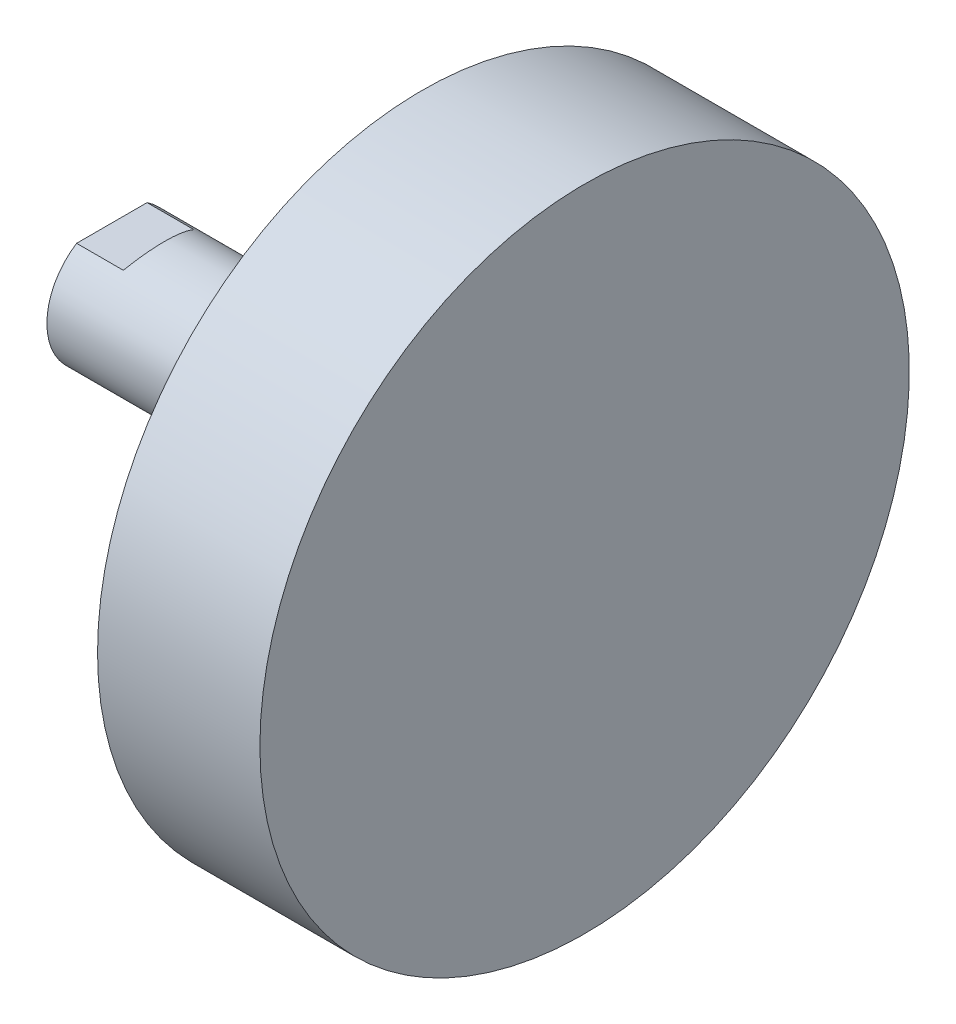
ISO-10303-21;
HEADER;
FILE_DESCRIPTION(('STEP AP214'),'2;1');
FILE_NAME('part.step','',(''),(''),'','','');
FILE_SCHEMA(('AUTOMOTIVE_DESIGN { 1 0 10303 214 1 1 1 1 }'));
ENDSEC;
DATA;
#1=APPLICATION_CONTEXT('core data for automotive mechanical design processes');
#2=APPLICATION_PROTOCOL_DEFINITION('international standard','automotive_design',2000,#1);
#3=PRODUCT_CONTEXT('',#1,'mechanical');
#4=PRODUCT('Part','Part','',(#3));
#5=PRODUCT_RELATED_PRODUCT_CATEGORY('part','',(#4));
#6=PRODUCT_DEFINITION_FORMATION('','',#4);
#7=PRODUCT_DEFINITION_CONTEXT('part definition',#1,'design');
#8=PRODUCT_DEFINITION('design','',#6,#7);
#9=PRODUCT_DEFINITION_SHAPE('','',#8);
#10=(LENGTH_UNIT() NAMED_UNIT(*) SI_UNIT(.MILLI.,.METRE.));
#11=(NAMED_UNIT(*) PLANE_ANGLE_UNIT() SI_UNIT($,.RADIAN.));
#12=(NAMED_UNIT(*) SI_UNIT($,.STERADIAN.) SOLID_ANGLE_UNIT());
#13=UNCERTAINTY_MEASURE_WITH_UNIT(LENGTH_MEASURE(1.E-05),#10,'distance_accuracy_value','');
#14=(GEOMETRIC_REPRESENTATION_CONTEXT(3) GLOBAL_UNCERTAINTY_ASSIGNED_CONTEXT((#13)) GLOBAL_UNIT_ASSIGNED_CONTEXT((#10,
#11,#12)) REPRESENTATION_CONTEXT('',''));
#15=CARTESIAN_POINT('',(0.,0.,0.));
#16=DIRECTION('',(0.,0.,1.));
#17=DIRECTION('',(1.,0.,0.));
#18=AXIS2_PLACEMENT_3D('',#15,#16,#17);
#19=CARTESIAN_POINT('',(80.,0.,0.));
#20=DIRECTION('',(-1.,0.,0.));
#21=DIRECTION('',(0.,0.,1.));
#22=AXIS2_PLACEMENT_3D('',#19,#20,#21);
#23=CYLINDRICAL_SURFACE('',#22,12.5);
#24=CARTESIAN_POINT('',(48.75,0.,0.));
#25=DIRECTION('',(1.,0.,0.));
#26=DIRECTION('',(0.,0.,-1.));
#27=AXIS2_PLACEMENT_3D('',#24,#25,#26);
#28=CIRCLE('',#27,12.5);
#29=CARTESIAN_POINT('',(48.75,0.,-12.5));
#30=VERTEX_POINT('',#29);
#31=EDGE_CURVE('E185',#30,#30,#28,.T.);
#32=ORIENTED_EDGE('',*,*,#31,.F.);
#33=EDGE_LOOP('',(#32));
#34=FACE_BOUND('',#33,.T.);
#35=DIRECTION('',(-1.,0.,0.));
#36=VECTOR('',#35,1.);
#37=CARTESIAN_POINT('',(80.,-10.5,6.78232998312527));
#38=LINE('',#37,#36);
#39=CARTESIAN_POINT('',(-2.,-10.5,6.78232998312527));
#40=VERTEX_POINT('',#39);
#41=CARTESIAN_POINT('',(-11.,-10.5,6.78232998312527));
#42=VERTEX_POINT('',#41);
#43=EDGE_CURVE('E52',#40,#42,#38,.T.);
#44=ORIENTED_EDGE('',*,*,#43,.F.);
#45=CARTESIAN_POINT('',(-8.0621778264911,0.,0.));
#46=DIRECTION('',(-0.866025403784438,-0.500000000000002,0.));
#47=DIRECTION('',(-0.500000000000002,0.866025403784438,0.));
#48=AXIS2_PLACEMENT_3D('',#45,#46,#47);
#49=ELLIPSE('',#48,14.4337567297407,12.5);
#50=CARTESIAN_POINT('',(-2.,-10.5,-6.78232998312527));
#51=VERTEX_POINT('',#50);
#52=EDGE_CURVE('E11',#51,#40,#49,.T.);
#53=ORIENTED_EDGE('',*,*,#52,.F.);
#54=DIRECTION('',(-1.,0.,0.));
#55=VECTOR('',#54,1.);
#56=CARTESIAN_POINT('',(80.,-10.5,-6.78232998312527));
#57=LINE('',#56,#55);
#58=CARTESIAN_POINT('',(-11.,-10.5,-6.78232998312527));
#59=VERTEX_POINT('',#58);
#60=EDGE_CURVE('E172',#59,#51,#57,.F.);
#61=ORIENTED_EDGE('',*,*,#60,.F.);
#62=CARTESIAN_POINT('',(-11.,0.,0.));
#63=DIRECTION('',(-1.,0.,0.));
#64=DIRECTION('',(0.,0.,1.));
#65=AXIS2_PLACEMENT_3D('',#62,#63,#64);
#66=CIRCLE('',#65,12.5);
#67=CARTESIAN_POINT('',(-11.,10.5,-6.78232998312527));
#68=VERTEX_POINT('',#67);
#69=EDGE_CURVE('E184',#68,#59,#66,.T.);
#70=ORIENTED_EDGE('',*,*,#69,.F.);
#71=DIRECTION('',(-1.,0.,0.));
#72=VECTOR('',#71,1.);
#73=CARTESIAN_POINT('',(80.,10.5,-6.78232998312527));
#74=LINE('',#73,#72);
#75=CARTESIAN_POINT('',(-2.,10.5,-6.78232998312525));
#76=VERTEX_POINT('',#75);
#77=EDGE_CURVE('E60',#76,#68,#74,.T.);
#78=ORIENTED_EDGE('',*,*,#77,.F.);
#79=CARTESIAN_POINT('',(-8.06217782649105,0.,0.));
#80=DIRECTION('',(-0.86602540378444,0.499999999999998,0.));
#81=DIRECTION('',(-0.499999999999998,-0.86602540378444,0.));
#82=AXIS2_PLACEMENT_3D('',#79,#80,#81);
#83=ELLIPSE('',#82,14.4337567297406,12.5);
#84=CARTESIAN_POINT('',(-2.,10.5,6.78232998312527));
#85=VERTEX_POINT('',#84);
#86=EDGE_CURVE('E45',#85,#76,#83,.T.);
#87=ORIENTED_EDGE('',*,*,#86,.F.);
#88=DIRECTION('',(-1.,0.,0.));
#89=VECTOR('',#88,1.);
#90=CARTESIAN_POINT('',(80.,10.5,6.78232998312527));
#91=LINE('',#90,#89);
#92=CARTESIAN_POINT('',(-11.,10.5,6.78232998312527));
#93=VERTEX_POINT('',#92);
#94=EDGE_CURVE('E169',#93,#85,#91,.F.);
#95=ORIENTED_EDGE('',*,*,#94,.F.);
#96=EDGE_CURVE('E181',#42,#93,#66,.T.);
#97=ORIENTED_EDGE('',*,*,#96,.F.);
#98=EDGE_LOOP('',(#44,#53,#61,#70,#78,#87,#95,#97));
#99=FACE_BOUND('',#98,.T.);
#100=ADVANCED_FACE('F37',(#34,#99),#23,.T.);
#101=CARTESIAN_POINT('',(-11.,0.,0.));
#102=DIRECTION('',(1.,0.,0.));
#103=DIRECTION('',(0.,0.,-1.));
#104=AXIS2_PLACEMENT_3D('',#101,#102,#103);
#105=PLANE('',#104);
#106=CARTESIAN_POINT('',(-11.,0.,0.));
#107=DIRECTION('',(-1.,0.,0.));
#108=DIRECTION('',(0.,0.,1.));
#109=AXIS2_PLACEMENT_3D('',#106,#107,#108);
#110=CIRCLE('',#109,9.5);
#111=CARTESIAN_POINT('',(-11.,0.,9.5));
#112=VERTEX_POINT('',#111);
#113=EDGE_CURVE('E161',#112,#112,#110,.T.);
#114=ORIENTED_EDGE('',*,*,#113,.F.);
#115=EDGE_LOOP('',(#114));
#116=FACE_BOUND('',#115,.T.);
#117=DIRECTION('',(0.,0.,-1.));
#118=VECTOR('',#117,1.);
#119=CARTESIAN_POINT('',(-11.,-10.5,0.));
#120=LINE('',#119,#118);
#121=EDGE_CURVE('E190',#42,#59,#120,.T.);
#122=ORIENTED_EDGE('',*,*,#121,.F.);
#123=ORIENTED_EDGE('',*,*,#96,.T.);
#124=DIRECTION('',(0.,0.,1.));
#125=VECTOR('',#124,1.);
#126=CARTESIAN_POINT('',(-11.,10.5,0.));
#127=LINE('',#126,#125);
#128=EDGE_CURVE('E188',#68,#93,#127,.T.);
#129=ORIENTED_EDGE('',*,*,#128,.F.);
#130=ORIENTED_EDGE('',*,*,#69,.T.);
#131=EDGE_LOOP('',(#122,#123,#129,#130));
#132=FACE_BOUND('',#131,.T.);
#133=ADVANCED_FACE('F39',(#116,#132),#105,.F.);
#134=CARTESIAN_POINT('',(48.75,0.,0.));
#135=DIRECTION('',(1.,0.,0.));
#136=DIRECTION('',(0.,0.,-1.));
#137=AXIS2_PLACEMENT_3D('',#134,#135,#136);
#138=PLANE('',#137);
#139=ORIENTED_EDGE('',*,*,#31,.T.);
#140=EDGE_LOOP('',(#139));
#141=FACE_BOUND('',#140,.T.);
#142=CARTESIAN_POINT('',(48.75,0.,0.));
#143=DIRECTION('',(-1.,0.,0.));
#144=DIRECTION('',(0.,0.,1.));
#145=AXIS2_PLACEMENT_3D('',#142,#143,#144);
#146=CIRCLE('',#145,62.5);
#147=CARTESIAN_POINT('',(48.75,0.,62.5));
#148=VERTEX_POINT('',#147);
#149=EDGE_CURVE('E178',#148,#148,#146,.T.);
#150=ORIENTED_EDGE('',*,*,#149,.T.);
#151=EDGE_LOOP('',(#150));
#152=FACE_BOUND('',#151,.T.);
#153=ADVANCED_FACE('F97',(#141,#152),#138,.F.);
#154=CARTESIAN_POINT('',(80.,0.,0.));
#155=DIRECTION('',(-1.,0.,0.));
#156=DIRECTION('',(0.,0.,1.));
#157=AXIS2_PLACEMENT_3D('',#154,#155,#156);
#158=CYLINDRICAL_SURFACE('',#157,62.5);
#159=ORIENTED_EDGE('',*,*,#149,.F.);
#160=EDGE_LOOP('',(#159));
#161=FACE_BOUND('',#160,.T.);
#162=CARTESIAN_POINT('',(80.,0.,0.));
#163=DIRECTION('',(-1.,0.,0.));
#164=DIRECTION('',(0.,0.,1.));
#165=AXIS2_PLACEMENT_3D('',#162,#163,#164);
#166=CIRCLE('',#165,62.5);
#167=CARTESIAN_POINT('',(80.,0.,62.5));
#168=VERTEX_POINT('',#167);
#169=EDGE_CURVE('E175',#168,#168,#166,.T.);
#170=ORIENTED_EDGE('',*,*,#169,.T.);
#171=EDGE_LOOP('',(#170));
#172=FACE_BOUND('',#171,.T.);
#173=ADVANCED_FACE('F106',(#161,#172),#158,.T.);
#174=CARTESIAN_POINT('',(80.,12.5,0.));
#175=DIRECTION('',(-1.,0.,0.));
#176=DIRECTION('',(0.,0.,1.));
#177=AXIS2_PLACEMENT_3D('',#174,#175,#176);
#178=PLANE('',#177);
#179=ORIENTED_EDGE('',*,*,#169,.F.);
#180=EDGE_LOOP('',(#179));
#181=FACE_BOUND('',#180,.T.);
#182=ADVANCED_FACE('F102',(#181),#178,.F.);
#183=CARTESIAN_POINT('',(-11.,10.5,25.));
#184=DIRECTION('',(0.,1.,0.));
#185=DIRECTION('',(0.,0.,1.));
#186=AXIS2_PLACEMENT_3D('',#183,#184,#185);
#187=PLANE('',#186);
#188=ORIENTED_EDGE('',*,*,#77,.T.);
#189=ORIENTED_EDGE('',*,*,#128,.T.);
#190=ORIENTED_EDGE('',*,*,#94,.T.);
#191=DIRECTION('',(0.,0.,-1.));
#192=VECTOR('',#191,1.);
#193=CARTESIAN_POINT('',(-2.,10.5,25.));
#194=LINE('',#193,#192);
#195=EDGE_CURVE('E164',#85,#76,#194,.T.);
#196=ORIENTED_EDGE('',*,*,#195,.T.);
#197=EDGE_LOOP('',(#188,#189,#190,#196));
#198=FACE_BOUND('',#197,.T.);
#199=ADVANCED_FACE('F105',(#198),#187,.T.);
#200=CARTESIAN_POINT('',(-2.,10.5,25.));
#201=DIRECTION('',(-0.86602540378444,0.499999999999998,0.));
#202=DIRECTION('',(-0.499999999999998,-0.86602540378444,0.));
#203=AXIS2_PLACEMENT_3D('',#200,#201,#202);
#204=PLANE('',#203);
#205=ORIENTED_EDGE('',*,*,#86,.T.);
#206=ORIENTED_EDGE('',*,*,#195,.F.);
#207=EDGE_LOOP('',(#205,#206));
#208=FACE_BOUND('',#207,.T.);
#209=ADVANCED_FACE('F118',(#208),#204,.T.);
#210=CARTESIAN_POINT('',(8.1036297108185,-28.,25.));
#211=DIRECTION('',(-0.866025403784438,-0.500000000000002,0.));
#212=DIRECTION('',(0.500000000000002,-0.866025403784438,0.));
#213=AXIS2_PLACEMENT_3D('',#210,#211,#212);
#214=PLANE('',#213);
#215=ORIENTED_EDGE('',*,*,#52,.T.);
#216=DIRECTION('',(0.,0.,-1.));
#217=VECTOR('',#216,1.);
#218=CARTESIAN_POINT('',(-2.,-10.5,25.));
#219=LINE('',#218,#217);
#220=EDGE_CURVE('E166',#40,#51,#219,.T.);
#221=ORIENTED_EDGE('',*,*,#220,.T.);
#222=EDGE_LOOP('',(#215,#221));
#223=FACE_BOUND('',#222,.T.);
#224=ADVANCED_FACE('F114',(#223),#214,.T.);
#225=CARTESIAN_POINT('',(-2.,-10.5,25.));
#226=DIRECTION('',(0.,-1.,0.));
#227=DIRECTION('',(0.,0.,-1.));
#228=AXIS2_PLACEMENT_3D('',#225,#226,#227);
#229=PLANE('',#228);
#230=ORIENTED_EDGE('',*,*,#43,.T.);
#231=ORIENTED_EDGE('',*,*,#121,.T.);
#232=ORIENTED_EDGE('',*,*,#60,.T.);
#233=ORIENTED_EDGE('',*,*,#220,.F.);
#234=EDGE_LOOP('',(#230,#231,#232,#233));
#235=FACE_BOUND('',#234,.T.);
#236=ADVANCED_FACE('F117',(#235),#229,.T.);
#237=CARTESIAN_POINT('',(-10.,0.,0.));
#238=DIRECTION('',(-1.,0.,0.));
#239=DIRECTION('',(0.,0.,1.));
#240=AXIS2_PLACEMENT_3D('',#237,#238,#239);
#241=CONICAL_SURFACE('',#240,8.5,0.785398163397447);
#242=ORIENTED_EDGE('',*,*,#113,.T.);
#243=EDGE_LOOP('',(#242));
#244=FACE_BOUND('',#243,.T.);
#245=CARTESIAN_POINT('',(-10.,0.,0.));
#246=DIRECTION('',(-1.,0.,0.));
#247=DIRECTION('',(0.,0.,1.));
#248=AXIS2_PLACEMENT_3D('',#245,#246,#247);
#249=CIRCLE('',#248,8.5);
#250=CARTESIAN_POINT('',(-10.,0.,8.5));
#251=VERTEX_POINT('',#250);
#252=EDGE_CURVE('E158',#251,#251,#249,.T.);
#253=ORIENTED_EDGE('',*,*,#252,.F.);
#254=EDGE_LOOP('',(#253));
#255=FACE_BOUND('',#254,.T.);
#256=ADVANCED_FACE('F122',(#244,#255),#241,.F.);
#257=CARTESIAN_POINT('',(24.493820487119,0.,0.));
#258=DIRECTION('',(-1.,0.,0.));
#259=DIRECTION('',(0.,0.,1.));
#260=AXIS2_PLACEMENT_3D('',#257,#258,#259);
#261=CYLINDRICAL_SURFACE('',#260,8.5);
#262=ORIENTED_EDGE('',*,*,#252,.T.);
#263=EDGE_LOOP('',(#262));
#264=FACE_BOUND('',#263,.T.);
#265=CARTESIAN_POINT('',(-4.,0.,0.));
#266=DIRECTION('',(-1.,0.,0.));
#267=DIRECTION('',(0.,0.,1.));
#268=AXIS2_PLACEMENT_3D('',#265,#266,#267);
#269=CIRCLE('',#268,8.5);
#270=CARTESIAN_POINT('',(-4.,0.,8.5));
#271=VERTEX_POINT('',#270);
#272=EDGE_CURVE('E152',#271,#271,#269,.T.);
#273=ORIENTED_EDGE('',*,*,#272,.F.);
#274=EDGE_LOOP('',(#273));
#275=FACE_BOUND('',#274,.T.);
#276=ADVANCED_FACE('F130',(#264,#275),#261,.F.);
#277=CARTESIAN_POINT('',(-4.,8.5,0.));
#278=DIRECTION('',(-1.,0.,0.));
#279=DIRECTION('',(0.,0.,1.));
#280=AXIS2_PLACEMENT_3D('',#277,#278,#279);
#281=PLANE('',#280);
#282=ORIENTED_EDGE('',*,*,#272,.T.);
#283=EDGE_LOOP('',(#282));
#284=FACE_BOUND('',#283,.T.);
#285=CARTESIAN_POINT('',(-4.,0.,0.));
#286=DIRECTION('',(-1.,0.,0.));
#287=DIRECTION('',(0.,0.,1.));
#288=AXIS2_PLACEMENT_3D('',#285,#286,#287);
#289=CIRCLE('',#288,8.);
#290=CARTESIAN_POINT('',(-4.,0.,8.));
#291=VERTEX_POINT('',#290);
#292=EDGE_CURVE('E146',#291,#291,#289,.T.);
#293=ORIENTED_EDGE('',*,*,#292,.F.);
#294=EDGE_LOOP('',(#293));
#295=FACE_BOUND('',#294,.T.);
#296=ADVANCED_FACE('F134',(#284,#295),#281,.T.);
#297=CARTESIAN_POINT('',(-2.9175,0.,0.));
#298=DIRECTION('',(-1.,0.,0.));
#299=DIRECTION('',(0.,0.,1.));
#300=AXIS2_PLACEMENT_3D('',#297,#298,#299);
#301=CONICAL_SURFACE('',#300,6.9175,0.785398163397448);
#302=ORIENTED_EDGE('',*,*,#292,.T.);
#303=EDGE_LOOP('',(#302));
#304=FACE_BOUND('',#303,.T.);
#305=CARTESIAN_POINT('',(-2.9175,0.,0.));
#306=DIRECTION('',(-1.,0.,0.));
#307=DIRECTION('',(0.,0.,1.));
#308=AXIS2_PLACEMENT_3D('',#305,#306,#307);
#309=CIRCLE('',#308,6.9175);
#310=CARTESIAN_POINT('',(-2.9175,0.,6.9175));
#311=VERTEX_POINT('',#310);
#312=EDGE_CURVE('E149',#311,#311,#309,.T.);
#313=ORIENTED_EDGE('',*,*,#312,.F.);
#314=EDGE_LOOP('',(#313));
#315=FACE_BOUND('',#314,.T.);
#316=ADVANCED_FACE('F88',(#304,#315),#301,.F.);
#317=CARTESIAN_POINT('',(24.493820487119,0.,0.));
#318=DIRECTION('',(-1.,0.,0.));
#319=DIRECTION('',(0.,0.,1.));
#320=AXIS2_PLACEMENT_3D('',#317,#318,#319);
#321=CYLINDRICAL_SURFACE('',#320,6.9175);
#322=ORIENTED_EDGE('',*,*,#312,.T.);
#323=EDGE_LOOP('',(#322));
#324=FACE_BOUND('',#323,.T.);
#325=CARTESIAN_POINT('',(20.5,0.,0.));
#326=DIRECTION('',(-1.,0.,0.));
#327=DIRECTION('',(0.,0.,1.));
#328=AXIS2_PLACEMENT_3D('',#325,#326,#327);
#329=CIRCLE('',#328,6.9175);
#330=CARTESIAN_POINT('',(20.5,0.,6.9175));
#331=VERTEX_POINT('',#330);
#332=EDGE_CURVE('E150',#331,#331,#329,.T.);
#333=ORIENTED_EDGE('',*,*,#332,.F.);
#334=EDGE_LOOP('',(#333));
#335=FACE_BOUND('',#334,.T.);
#336=ADVANCED_FACE('F82',(#324,#335),#321,.F.);
#337=CARTESIAN_POINT('',(24.493820487119,0.,0.));
#338=DIRECTION('',(-1.,0.,0.));
#339=DIRECTION('',(0.,0.,1.));
#340=AXIS2_PLACEMENT_3D('',#337,#338,#339);
#341=CONICAL_SURFACE('',#340,0.,1.04719755119662);
#342=ORIENTED_EDGE('',*,*,#332,.T.);
#343=EDGE_LOOP('',(#342));
#344=FACE_BOUND('',#343,.T.);
#345=CARTESIAN_POINT('',(24.493820487119,0.,0.));
#346=VERTEX_POINT('',#345);
#347=VERTEX_LOOP('',#346);
#348=FACE_BOUND('',#347,.T.);
#349=ADVANCED_FACE('F80',(#344,#348),#341,.F.);
#350=CLOSED_SHELL('',(#100,#133,#153,#173,#182,#199,#209,#224,#236,#256,#276,#296,#316,#336,#349));
#351=MANIFOLD_SOLID_BREP('B2',#350);
#352=ADVANCED_BREP_SHAPE_REPRESENTATION('',(#18,#351),#14);
#353=SHAPE_DEFINITION_REPRESENTATION(#9,#352);
ENDSEC;
END-ISO-10303-21;
